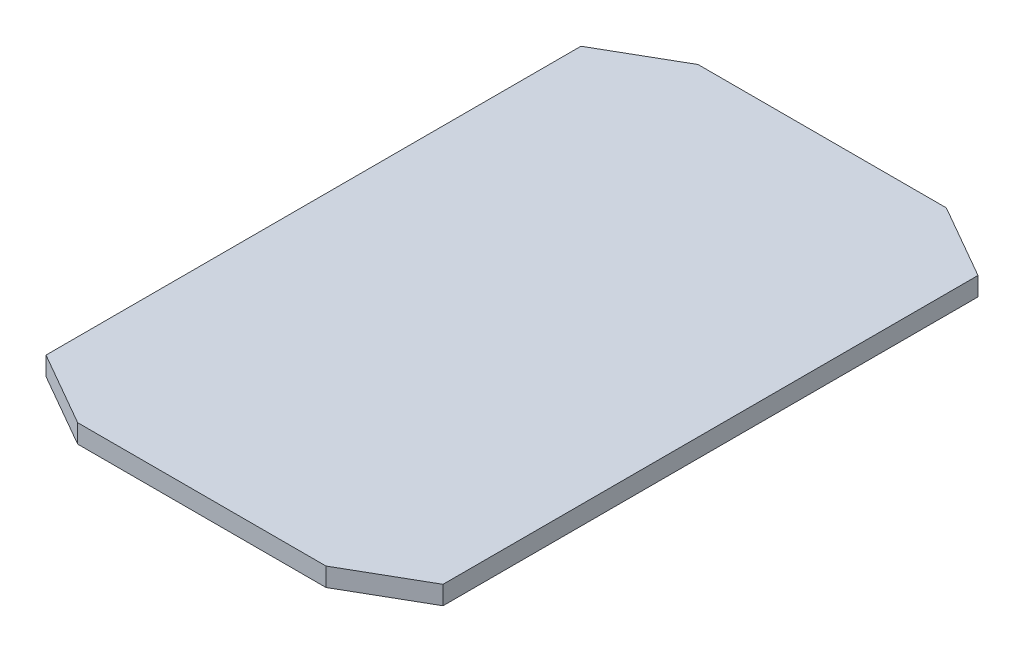
ISO-10303-21;
HEADER;
FILE_DESCRIPTION(('STEP AP214'),'2;1');
FILE_NAME('part.step','',(''),(''),'','','');
FILE_SCHEMA(('AUTOMOTIVE_DESIGN { 1 0 10303 214 1 1 1 1 }'));
ENDSEC;
DATA;
#1=APPLICATION_CONTEXT('core data for automotive mechanical design processes');
#2=APPLICATION_PROTOCOL_DEFINITION('international standard','automotive_design',2000,#1);
#3=PRODUCT_CONTEXT('',#1,'mechanical');
#4=PRODUCT('Part','Part','',(#3));
#5=PRODUCT_RELATED_PRODUCT_CATEGORY('part','',(#4));
#6=PRODUCT_DEFINITION_FORMATION('','',#4);
#7=PRODUCT_DEFINITION_CONTEXT('part definition',#1,'design');
#8=PRODUCT_DEFINITION('design','',#6,#7);
#9=PRODUCT_DEFINITION_SHAPE('','',#8);
#10=(LENGTH_UNIT() NAMED_UNIT(*) SI_UNIT(.MILLI.,.METRE.));
#11=(NAMED_UNIT(*) PLANE_ANGLE_UNIT() SI_UNIT($,.RADIAN.));
#12=(NAMED_UNIT(*) SI_UNIT($,.STERADIAN.) SOLID_ANGLE_UNIT());
#13=UNCERTAINTY_MEASURE_WITH_UNIT(LENGTH_MEASURE(1.E-05),#10,'distance_accuracy_value','');
#14=(GEOMETRIC_REPRESENTATION_CONTEXT(3) GLOBAL_UNCERTAINTY_ASSIGNED_CONTEXT((#13)) GLOBAL_UNIT_ASSIGNED_CONTEXT((#10,
#11,#12)) REPRESENTATION_CONTEXT('',''));
#15=CARTESIAN_POINT('',(0.,0.,0.));
#16=DIRECTION('',(0.,0.,1.));
#17=DIRECTION('',(1.,0.,0.));
#18=AXIS2_PLACEMENT_3D('',#15,#16,#17);
#19=CARTESIAN_POINT('',(-32.,3.,43.1177077057705));
#20=DIRECTION('',(1.,0.,0.));
#21=DIRECTION('',(0.,0.,-1.));
#22=AXIS2_PLACEMENT_3D('',#19,#20,#21);
#23=PLANE('',#22);
#24=DIRECTION('',(0.,0.,1.));
#25=VECTOR('',#24,1.);
#26=CARTESIAN_POINT('',(-32.,0.,43.1177077057705));
#27=LINE('',#26,#25);
#28=CARTESIAN_POINT('',(-32.,0.,-43.1177077057705));
#29=VERTEX_POINT('',#28);
#30=CARTESIAN_POINT('',(-32.,0.,43.1177077057705));
#31=VERTEX_POINT('',#30);
#32=EDGE_CURVE('E133',#29,#31,#27,.T.);
#33=ORIENTED_EDGE('',*,*,#32,.T.);
#34=DIRECTION('',(0.,-1.,0.));
#35=VECTOR('',#34,1.);
#36=CARTESIAN_POINT('',(-32.,3.,43.1177077057705));
#37=LINE('',#36,#35);
#38=CARTESIAN_POINT('',(-32.,3.,43.1177077057705));
#39=VERTEX_POINT('',#38);
#40=EDGE_CURVE('E11',#39,#31,#37,.T.);
#41=ORIENTED_EDGE('',*,*,#40,.F.);
#42=DIRECTION('',(0.,0.,1.));
#43=VECTOR('',#42,1.);
#44=CARTESIAN_POINT('',(-32.,3.,43.1177077057705));
#45=LINE('',#44,#43);
#46=CARTESIAN_POINT('',(-32.,3.,-43.1177077057705));
#47=VERTEX_POINT('',#46);
#48=EDGE_CURVE('E147',#47,#39,#45,.T.);
#49=ORIENTED_EDGE('',*,*,#48,.F.);
#50=DIRECTION('',(0.,-1.,0.));
#51=VECTOR('',#50,1.);
#52=CARTESIAN_POINT('',(-32.,3.,-43.1177077057705));
#53=LINE('',#52,#51);
#54=EDGE_CURVE('E129',#47,#29,#53,.T.);
#55=ORIENTED_EDGE('',*,*,#54,.T.);
#56=EDGE_LOOP('',(#33,#41,#49,#55));
#57=FACE_BOUND('',#56,.T.);
#58=ADVANCED_FACE('F37',(#57),#23,.F.);
#59=CARTESIAN_POINT('',(-32.,3.,43.1177077057705));
#60=DIRECTION('',(0.49788015877383,0.,-0.867245840289445));
#61=DIRECTION('',(-0.867245840289445,0.,-0.49788015877383));
#62=AXIS2_PLACEMENT_3D('',#59,#60,#61);
#63=PLANE('',#62);
#64=DIRECTION('',(0.867245840289445,0.,0.49788015877383));
#65=VECTOR('',#64,1.);
#66=CARTESIAN_POINT('',(-32.,0.,43.1177077057705));
#67=LINE('',#66,#65);
#68=CARTESIAN_POINT('',(-20.0118955161297,0.,50.));
#69=VERTEX_POINT('',#68);
#70=EDGE_CURVE('E136',#31,#69,#67,.T.);
#71=ORIENTED_EDGE('',*,*,#70,.T.);
#72=DIRECTION('',(0.,-1.,0.));
#73=VECTOR('',#72,1.);
#74=CARTESIAN_POINT('',(-20.0118955161297,3.,50.));
#75=LINE('',#74,#73);
#76=CARTESIAN_POINT('',(-20.0118955161297,3.,50.));
#77=VERTEX_POINT('',#76);
#78=EDGE_CURVE('E45',#77,#69,#75,.T.);
#79=ORIENTED_EDGE('',*,*,#78,.F.);
#80=DIRECTION('',(0.867245840289445,0.,0.49788015877383));
#81=VECTOR('',#80,1.);
#82=CARTESIAN_POINT('',(-32.,3.,43.1177077057705));
#83=LINE('',#82,#81);
#84=EDGE_CURVE('E96',#39,#77,#83,.T.);
#85=ORIENTED_EDGE('',*,*,#84,.F.);
#86=ORIENTED_EDGE('',*,*,#40,.T.);
#87=EDGE_LOOP('',(#71,#79,#85,#86));
#88=FACE_BOUND('',#87,.T.);
#89=ADVANCED_FACE('F182',(#88),#63,.F.);
#90=CARTESIAN_POINT('',(-20.0118955161297,3.,50.));
#91=DIRECTION('',(0.,0.,-1.));
#92=DIRECTION('',(-1.,0.,0.));
#93=AXIS2_PLACEMENT_3D('',#90,#91,#92);
#94=PLANE('',#93);
#95=DIRECTION('',(1.,0.,0.));
#96=VECTOR('',#95,1.);
#97=CARTESIAN_POINT('',(-20.0118955161297,0.,50.));
#98=LINE('',#97,#96);
#99=CARTESIAN_POINT('',(20.0118955161297,0.,50.));
#100=VERTEX_POINT('',#99);
#101=EDGE_CURVE('E138',#69,#100,#98,.T.);
#102=ORIENTED_EDGE('',*,*,#101,.T.);
#103=DIRECTION('',(0.,-1.,0.));
#104=VECTOR('',#103,1.);
#105=CARTESIAN_POINT('',(20.0118955161297,3.,50.));
#106=LINE('',#105,#104);
#107=CARTESIAN_POINT('',(20.0118955161297,3.,50.));
#108=VERTEX_POINT('',#107);
#109=EDGE_CURVE('E154',#108,#100,#106,.T.);
#110=ORIENTED_EDGE('',*,*,#109,.F.);
#111=DIRECTION('',(1.,0.,0.));
#112=VECTOR('',#111,1.);
#113=CARTESIAN_POINT('',(-20.0118955161297,3.,50.));
#114=LINE('',#113,#112);
#115=EDGE_CURVE('E162',#77,#108,#114,.T.);
#116=ORIENTED_EDGE('',*,*,#115,.F.);
#117=ORIENTED_EDGE('',*,*,#78,.T.);
#118=EDGE_LOOP('',(#102,#110,#116,#117));
#119=FACE_BOUND('',#118,.T.);
#120=ADVANCED_FACE('F160',(#119),#94,.F.);
#121=CARTESIAN_POINT('',(32.,3.,43.1177077057705));
#122=DIRECTION('',(-0.49788015877383,0.,-0.867245840289445));
#123=DIRECTION('',(-0.867245840289445,0.,0.49788015877383));
#124=AXIS2_PLACEMENT_3D('',#121,#122,#123);
#125=PLANE('',#124);
#126=DIRECTION('',(0.867245840289445,0.,-0.49788015877383));
#127=VECTOR('',#126,1.);
#128=CARTESIAN_POINT('',(32.,0.,43.1177077057705));
#129=LINE('',#128,#127);
#130=CARTESIAN_POINT('',(32.,0.,43.1177077057705));
#131=VERTEX_POINT('',#130);
#132=EDGE_CURVE('E140',#100,#131,#129,.T.);
#133=ORIENTED_EDGE('',*,*,#132,.T.);
#134=DIRECTION('',(0.,-1.,0.));
#135=VECTOR('',#134,1.);
#136=CARTESIAN_POINT('',(32.,3.,43.1177077057705));
#137=LINE('',#136,#135);
#138=CARTESIAN_POINT('',(32.,3.,43.1177077057705));
#139=VERTEX_POINT('',#138);
#140=EDGE_CURVE('E151',#139,#131,#137,.T.);
#141=ORIENTED_EDGE('',*,*,#140,.F.);
#142=DIRECTION('',(0.867245840289445,0.,-0.49788015877383));
#143=VECTOR('',#142,1.);
#144=CARTESIAN_POINT('',(32.,3.,43.1177077057705));
#145=LINE('',#144,#143);
#146=EDGE_CURVE('E174',#108,#139,#145,.T.);
#147=ORIENTED_EDGE('',*,*,#146,.F.);
#148=ORIENTED_EDGE('',*,*,#109,.T.);
#149=EDGE_LOOP('',(#133,#141,#147,#148));
#150=FACE_BOUND('',#149,.T.);
#151=ADVANCED_FACE('F170',(#150),#125,.F.);
#152=CARTESIAN_POINT('',(32.,3.,43.1177077057705));
#153=DIRECTION('',(-1.,0.,0.));
#154=DIRECTION('',(0.,0.,1.));
#155=AXIS2_PLACEMENT_3D('',#152,#153,#154);
#156=PLANE('',#155);
#157=DIRECTION('',(0.,0.,-1.));
#158=VECTOR('',#157,1.);
#159=CARTESIAN_POINT('',(32.,0.,43.1177077057705));
#160=LINE('',#159,#158);
#161=CARTESIAN_POINT('',(32.,0.,-43.1177077057705));
#162=VERTEX_POINT('',#161);
#163=EDGE_CURVE('E142',#131,#162,#160,.T.);
#164=ORIENTED_EDGE('',*,*,#163,.T.);
#165=DIRECTION('',(0.,-1.,0.));
#166=VECTOR('',#165,1.);
#167=CARTESIAN_POINT('',(32.,3.,-43.1177077057705));
#168=LINE('',#167,#166);
#169=CARTESIAN_POINT('',(32.,3.,-43.1177077057705));
#170=VERTEX_POINT('',#169);
#171=EDGE_CURVE('E124',#170,#162,#168,.T.);
#172=ORIENTED_EDGE('',*,*,#171,.F.);
#173=DIRECTION('',(0.,0.,-1.));
#174=VECTOR('',#173,1.);
#175=CARTESIAN_POINT('',(32.,3.,43.1177077057705));
#176=LINE('',#175,#174);
#177=EDGE_CURVE('E115',#139,#170,#176,.T.);
#178=ORIENTED_EDGE('',*,*,#177,.F.);
#179=ORIENTED_EDGE('',*,*,#140,.T.);
#180=EDGE_LOOP('',(#164,#172,#178,#179));
#181=FACE_BOUND('',#180,.T.);
#182=ADVANCED_FACE('F173',(#181),#156,.F.);
#183=CARTESIAN_POINT('',(32.,3.,-43.1177077057705));
#184=DIRECTION('',(-0.49788015877383,0.,0.867245840289445));
#185=DIRECTION('',(0.867245840289445,0.,0.49788015877383));
#186=AXIS2_PLACEMENT_3D('',#183,#184,#185);
#187=PLANE('',#186);
#188=DIRECTION('',(-0.867245840289445,0.,-0.49788015877383));
#189=VECTOR('',#188,1.);
#190=CARTESIAN_POINT('',(32.,0.,-43.1177077057705));
#191=LINE('',#190,#189);
#192=CARTESIAN_POINT('',(20.0118955161297,0.,-50.));
#193=VERTEX_POINT('',#192);
#194=EDGE_CURVE('E123',#162,#193,#191,.T.);
#195=ORIENTED_EDGE('',*,*,#194,.T.);
#196=DIRECTION('',(0.,-1.,0.));
#197=VECTOR('',#196,1.);
#198=CARTESIAN_POINT('',(20.0118955161297,3.,-50.));
#199=LINE('',#198,#197);
#200=CARTESIAN_POINT('',(20.0118955161297,3.,-50.));
#201=VERTEX_POINT('',#200);
#202=EDGE_CURVE('E120',#201,#193,#199,.T.);
#203=ORIENTED_EDGE('',*,*,#202,.F.);
#204=DIRECTION('',(-0.867245840289445,0.,-0.49788015877383));
#205=VECTOR('',#204,1.);
#206=CARTESIAN_POINT('',(32.,3.,-43.1177077057705));
#207=LINE('',#206,#205);
#208=EDGE_CURVE('E109',#170,#201,#207,.T.);
#209=ORIENTED_EDGE('',*,*,#208,.F.);
#210=ORIENTED_EDGE('',*,*,#171,.T.);
#211=EDGE_LOOP('',(#195,#203,#209,#210));
#212=FACE_BOUND('',#211,.T.);
#213=ADVANCED_FACE('F121',(#212),#187,.F.);
#214=CARTESIAN_POINT('',(-20.0118955161297,3.,-50.));
#215=DIRECTION('',(0.,0.,1.));
#216=DIRECTION('',(1.,0.,0.));
#217=AXIS2_PLACEMENT_3D('',#214,#215,#216);
#218=PLANE('',#217);
#219=DIRECTION('',(-1.,0.,0.));
#220=VECTOR('',#219,1.);
#221=CARTESIAN_POINT('',(-20.0118955161297,0.,-50.));
#222=LINE('',#221,#220);
#223=CARTESIAN_POINT('',(-20.0118955161297,0.,-50.));
#224=VERTEX_POINT('',#223);
#225=EDGE_CURVE('E82',#193,#224,#222,.T.);
#226=ORIENTED_EDGE('',*,*,#225,.T.);
#227=DIRECTION('',(0.,-1.,0.));
#228=VECTOR('',#227,1.);
#229=CARTESIAN_POINT('',(-20.0118955161297,3.,-50.));
#230=LINE('',#229,#228);
#231=CARTESIAN_POINT('',(-20.0118955161297,3.,-50.));
#232=VERTEX_POINT('',#231);
#233=EDGE_CURVE('E125',#232,#224,#230,.T.);
#234=ORIENTED_EDGE('',*,*,#233,.F.);
#235=DIRECTION('',(-1.,0.,0.));
#236=VECTOR('',#235,1.);
#237=CARTESIAN_POINT('',(-20.0118955161297,3.,-50.));
#238=LINE('',#237,#236);
#239=EDGE_CURVE('E113',#201,#232,#238,.T.);
#240=ORIENTED_EDGE('',*,*,#239,.F.);
#241=ORIENTED_EDGE('',*,*,#202,.T.);
#242=EDGE_LOOP('',(#226,#234,#240,#241));
#243=FACE_BOUND('',#242,.T.);
#244=ADVANCED_FACE('F127',(#243),#218,.F.);
#245=CARTESIAN_POINT('',(-32.,3.,-43.1177077057705));
#246=DIRECTION('',(0.49788015877383,0.,0.867245840289445));
#247=DIRECTION('',(0.867245840289445,0.,-0.49788015877383));
#248=AXIS2_PLACEMENT_3D('',#245,#246,#247);
#249=PLANE('',#248);
#250=DIRECTION('',(-0.867245840289445,0.,0.49788015877383));
#251=VECTOR('',#250,1.);
#252=CARTESIAN_POINT('',(-32.,0.,-43.1177077057705));
#253=LINE('',#252,#251);
#254=EDGE_CURVE('E88',#224,#29,#253,.T.);
#255=ORIENTED_EDGE('',*,*,#254,.T.);
#256=ORIENTED_EDGE('',*,*,#54,.F.);
#257=DIRECTION('',(-0.867245840289445,0.,0.49788015877383));
#258=VECTOR('',#257,1.);
#259=CARTESIAN_POINT('',(-32.,3.,-43.1177077057705));
#260=LINE('',#259,#258);
#261=EDGE_CURVE('E53',#232,#47,#260,.T.);
#262=ORIENTED_EDGE('',*,*,#261,.F.);
#263=ORIENTED_EDGE('',*,*,#233,.T.);
#264=EDGE_LOOP('',(#255,#256,#262,#263));
#265=FACE_BOUND('',#264,.T.);
#266=ADVANCED_FACE('F198',(#265),#249,.F.);
#267=CARTESIAN_POINT('',(0.,3.,0.));
#268=DIRECTION('',(0.,-1.,0.));
#269=DIRECTION('',(0.,0.,-1.));
#270=AXIS2_PLACEMENT_3D('',#267,#268,#269);
#271=PLANE('',#270);
#272=ORIENTED_EDGE('',*,*,#48,.T.);
#273=ORIENTED_EDGE('',*,*,#84,.T.);
#274=ORIENTED_EDGE('',*,*,#115,.T.);
#275=ORIENTED_EDGE('',*,*,#146,.T.);
#276=ORIENTED_EDGE('',*,*,#177,.T.);
#277=ORIENTED_EDGE('',*,*,#208,.T.);
#278=ORIENTED_EDGE('',*,*,#239,.T.);
#279=ORIENTED_EDGE('',*,*,#261,.T.);
#280=EDGE_LOOP('',(#272,#273,#274,#275,#276,#277,#278,#279));
#281=FACE_BOUND('',#280,.T.);
#282=ADVANCED_FACE('F111',(#281),#271,.F.);
#283=CARTESIAN_POINT('',(0.,0.,0.));
#284=DIRECTION('',(0.,-1.,0.));
#285=DIRECTION('',(0.,0.,-1.));
#286=AXIS2_PLACEMENT_3D('',#283,#284,#285);
#287=PLANE('',#286);
#288=ORIENTED_EDGE('',*,*,#32,.F.);
#289=ORIENTED_EDGE('',*,*,#254,.F.);
#290=ORIENTED_EDGE('',*,*,#225,.F.);
#291=ORIENTED_EDGE('',*,*,#194,.F.);
#292=ORIENTED_EDGE('',*,*,#163,.F.);
#293=ORIENTED_EDGE('',*,*,#132,.F.);
#294=ORIENTED_EDGE('',*,*,#101,.F.);
#295=ORIENTED_EDGE('',*,*,#70,.F.);
#296=EDGE_LOOP('',(#288,#289,#290,#291,#292,#293,#294,#295));
#297=FACE_BOUND('',#296,.T.);
#298=ADVANCED_FACE('F166',(#297),#287,.T.);
#299=CLOSED_SHELL('',(#58,#89,#120,#151,#182,#213,#244,#266,#282,#298));
#300=MANIFOLD_SOLID_BREP('B2',#299);
#301=ADVANCED_BREP_SHAPE_REPRESENTATION('',(#18,#300),#14);
#302=SHAPE_DEFINITION_REPRESENTATION(#9,#301);
ENDSEC;
END-ISO-10303-21;
